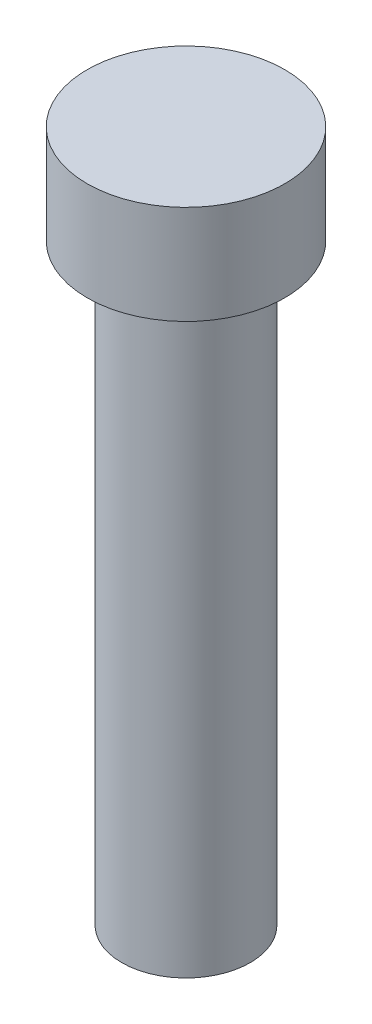
ISO-10303-21;
HEADER;
FILE_DESCRIPTION(('STEP AP214'),'2;1');
FILE_NAME('part.step','',(''),(''),'','','');
FILE_SCHEMA(('AUTOMOTIVE_DESIGN { 1 0 10303 214 1 1 1 1 }'));
ENDSEC;
DATA;
#1=APPLICATION_CONTEXT('core data for automotive mechanical design processes');
#2=APPLICATION_PROTOCOL_DEFINITION('international standard','automotive_design',2000,#1);
#3=PRODUCT_CONTEXT('',#1,'mechanical');
#4=PRODUCT('Part','Part','',(#3));
#5=PRODUCT_RELATED_PRODUCT_CATEGORY('part','',(#4));
#6=PRODUCT_DEFINITION_FORMATION('','',#4);
#7=PRODUCT_DEFINITION_CONTEXT('part definition',#1,'design');
#8=PRODUCT_DEFINITION('design','',#6,#7);
#9=PRODUCT_DEFINITION_SHAPE('','',#8);
#10=(LENGTH_UNIT() NAMED_UNIT(*) SI_UNIT(.MILLI.,.METRE.));
#11=(NAMED_UNIT(*) PLANE_ANGLE_UNIT() SI_UNIT($,.RADIAN.));
#12=(NAMED_UNIT(*) SI_UNIT($,.STERADIAN.) SOLID_ANGLE_UNIT());
#13=UNCERTAINTY_MEASURE_WITH_UNIT(LENGTH_MEASURE(1.E-05),#10,'distance_accuracy_value','');
#14=(GEOMETRIC_REPRESENTATION_CONTEXT(3) GLOBAL_UNCERTAINTY_ASSIGNED_CONTEXT((#13)) GLOBAL_UNIT_ASSIGNED_CONTEXT((#10,
#11,#12)) REPRESENTATION_CONTEXT('',''));
#15=CARTESIAN_POINT('',(0.,0.,0.));
#16=DIRECTION('',(0.,0.,1.));
#17=DIRECTION('',(1.,0.,0.));
#18=AXIS2_PLACEMENT_3D('',#15,#16,#17);
#19=CARTESIAN_POINT('',(0.,30.,0.));
#20=DIRECTION('',(0.,-1.,0.));
#21=DIRECTION('',(0.,0.,-1.));
#22=AXIS2_PLACEMENT_3D('',#19,#20,#21);
#23=CYLINDRICAL_SURFACE('',#22,3.25);
#24=CARTESIAN_POINT('',(0.,30.,0.));
#25=DIRECTION('',(0.,1.,0.));
#26=DIRECTION('',(0.,0.,1.));
#27=AXIS2_PLACEMENT_3D('',#24,#25,#26);
#28=CIRCLE('',#27,3.25);
#29=CARTESIAN_POINT('',(0.,30.,3.25));
#30=VERTEX_POINT('',#29);
#31=EDGE_CURVE('E10',#30,#30,#28,.T.);
#32=ORIENTED_EDGE('',*,*,#31,.F.);
#33=EDGE_LOOP('',(#32));
#34=FACE_BOUND('',#33,.T.);
#35=CARTESIAN_POINT('',(0.,0.,0.));
#36=DIRECTION('',(0.,1.,0.));
#37=DIRECTION('',(0.,0.,1.));
#38=AXIS2_PLACEMENT_3D('',#35,#36,#37);
#39=CIRCLE('',#38,3.25);
#40=CARTESIAN_POINT('',(0.,0.,3.25));
#41=VERTEX_POINT('',#40);
#42=EDGE_CURVE('E40',#41,#41,#39,.T.);
#43=ORIENTED_EDGE('',*,*,#42,.T.);
#44=EDGE_LOOP('',(#43));
#45=FACE_BOUND('',#44,.T.);
#46=ADVANCED_FACE('F37',(#34,#45),#23,.T.);
#47=CARTESIAN_POINT('',(0.,0.,0.));
#48=DIRECTION('',(0.,1.,0.));
#49=DIRECTION('',(0.,0.,1.));
#50=AXIS2_PLACEMENT_3D('',#47,#48,#49);
#51=PLANE('',#50);
#52=ORIENTED_EDGE('',*,*,#42,.F.);
#53=EDGE_LOOP('',(#52));
#54=FACE_BOUND('',#53,.T.);
#55=ADVANCED_FACE('F64',(#54),#51,.F.);
#56=CARTESIAN_POINT('',(0.,35.,0.));
#57=DIRECTION('',(0.,-1.,0.));
#58=DIRECTION('',(0.,0.,-1.));
#59=AXIS2_PLACEMENT_3D('',#56,#57,#58);
#60=CYLINDRICAL_SURFACE('',#59,5.);
#61=CARTESIAN_POINT('',(0.,35.,0.));
#62=DIRECTION('',(0.,1.,0.));
#63=DIRECTION('',(0.,0.,1.));
#64=AXIS2_PLACEMENT_3D('',#61,#62,#63);
#65=CIRCLE('',#64,5.);
#66=CARTESIAN_POINT('',(0.,35.,5.));
#67=VERTEX_POINT('',#66);
#68=EDGE_CURVE('E49',#67,#67,#65,.T.);
#69=ORIENTED_EDGE('',*,*,#68,.F.);
#70=EDGE_LOOP('',(#69));
#71=FACE_BOUND('',#70,.T.);
#72=CARTESIAN_POINT('',(0.,30.,0.));
#73=DIRECTION('',(0.,1.,0.));
#74=DIRECTION('',(0.,0.,1.));
#75=AXIS2_PLACEMENT_3D('',#72,#73,#74);
#76=CIRCLE('',#75,5.);
#77=CARTESIAN_POINT('',(0.,30.,5.));
#78=VERTEX_POINT('',#77);
#79=EDGE_CURVE('E51',#78,#78,#76,.T.);
#80=ORIENTED_EDGE('',*,*,#79,.T.);
#81=EDGE_LOOP('',(#80));
#82=FACE_BOUND('',#81,.T.);
#83=ADVANCED_FACE('F61',(#71,#82),#60,.T.);
#84=CARTESIAN_POINT('',(0.,35.,0.));
#85=DIRECTION('',(0.,1.,0.));
#86=DIRECTION('',(0.,0.,1.));
#87=AXIS2_PLACEMENT_3D('',#84,#85,#86);
#88=PLANE('',#87);
#89=ORIENTED_EDGE('',*,*,#68,.T.);
#90=EDGE_LOOP('',(#89));
#91=FACE_BOUND('',#90,.T.);
#92=ADVANCED_FACE('F59',(#91),#88,.T.);
#93=CARTESIAN_POINT('',(0.,30.,0.));
#94=DIRECTION('',(0.,1.,0.));
#95=DIRECTION('',(0.,0.,1.));
#96=AXIS2_PLACEMENT_3D('',#93,#94,#95);
#97=PLANE('',#96);
#98=ORIENTED_EDGE('',*,*,#31,.T.);
#99=EDGE_LOOP('',(#98));
#100=FACE_BOUND('',#99,.T.);
#101=ORIENTED_EDGE('',*,*,#79,.F.);
#102=EDGE_LOOP('',(#101));
#103=FACE_BOUND('',#102,.T.);
#104=ADVANCED_FACE('F68',(#100,#103),#97,.F.);
#105=CLOSED_SHELL('',(#46,#55,#83,#92,#104));
#106=MANIFOLD_SOLID_BREP('B2',#105);
#107=ADVANCED_BREP_SHAPE_REPRESENTATION('',(#18,#106),#14);
#108=SHAPE_DEFINITION_REPRESENTATION(#9,#107);
ENDSEC;
END-ISO-10303-21;
